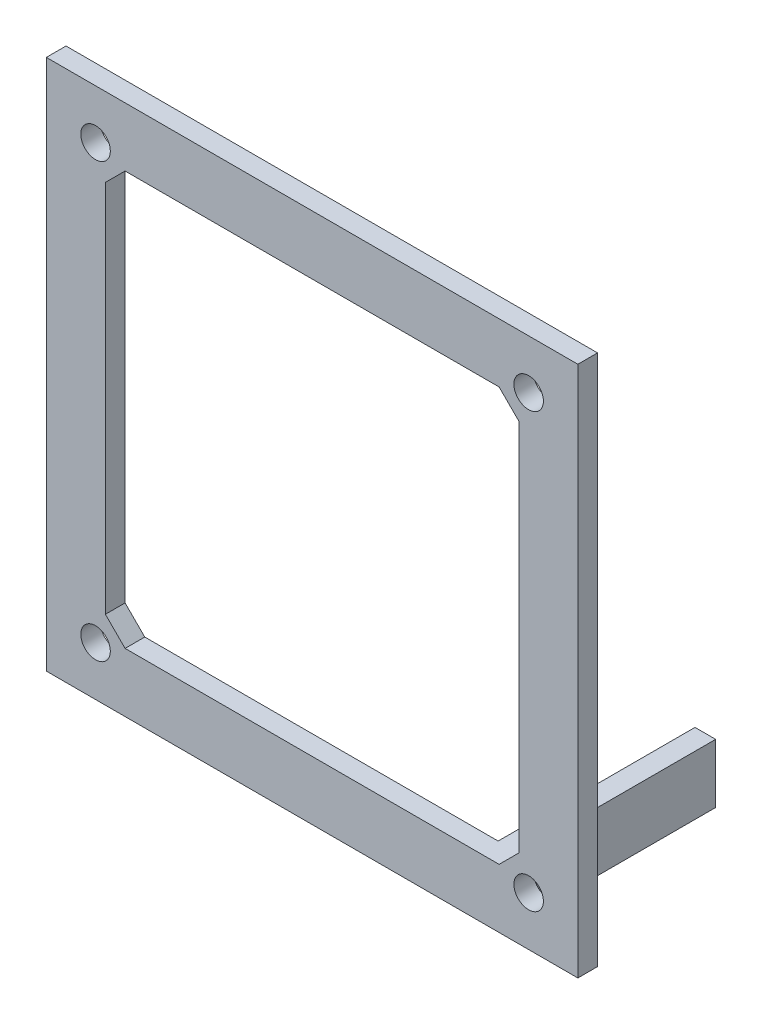
ISO-10303-21;
HEADER;
FILE_DESCRIPTION(('STEP AP214'),'2;1');
FILE_NAME('part.step','',(''),(''),'','','');
FILE_SCHEMA(('AUTOMOTIVE_DESIGN { 1 0 10303 214 1 1 1 1 }'));
ENDSEC;
DATA;
#1=APPLICATION_CONTEXT('core data for automotive mechanical design processes');
#2=APPLICATION_PROTOCOL_DEFINITION('international standard','automotive_design',2000,#1);
#3=PRODUCT_CONTEXT('',#1,'mechanical');
#4=PRODUCT('Part','Part','',(#3));
#5=PRODUCT_RELATED_PRODUCT_CATEGORY('part','',(#4));
#6=PRODUCT_DEFINITION_FORMATION('','',#4);
#7=PRODUCT_DEFINITION_CONTEXT('part definition',#1,'design');
#8=PRODUCT_DEFINITION('design','',#6,#7);
#9=PRODUCT_DEFINITION_SHAPE('','',#8);
#10=(LENGTH_UNIT() NAMED_UNIT(*) SI_UNIT(.MILLI.,.METRE.));
#11=(NAMED_UNIT(*) PLANE_ANGLE_UNIT() SI_UNIT($,.RADIAN.));
#12=(NAMED_UNIT(*) SI_UNIT($,.STERADIAN.) SOLID_ANGLE_UNIT());
#13=UNCERTAINTY_MEASURE_WITH_UNIT(LENGTH_MEASURE(1.E-05),#10,'distance_accuracy_value','');
#14=(GEOMETRIC_REPRESENTATION_CONTEXT(3) GLOBAL_UNCERTAINTY_ASSIGNED_CONTEXT((#13)) GLOBAL_UNIT_ASSIGNED_CONTEXT((#10,
#11,#12)) REPRESENTATION_CONTEXT('',''));
#15=CARTESIAN_POINT('',(0.,0.,0.));
#16=DIRECTION('',(0.,0.,1.));
#17=DIRECTION('',(1.,0.,0.));
#18=AXIS2_PLACEMENT_3D('',#15,#16,#17);
#19=CARTESIAN_POINT('',(0.,0.,0.));
#20=DIRECTION('',(0.,0.,1.));
#21=DIRECTION('',(1.,0.,0.));
#22=AXIS2_PLACEMENT_3D('',#19,#20,#21);
#23=PLANE('',#22);
#24=CARTESIAN_POINT('',(-70.7747798287289,-23.2326109767206,0.));
#25=DIRECTION('',(0.,0.,1.));
#26=DIRECTION('',(1.,0.,0.));
#27=AXIS2_PLACEMENT_3D('',#24,#25,#26);
#28=CIRCLE('',#27,1.5);
#29=CARTESIAN_POINT('',(-69.2747798287289,-23.2326109767206,0.));
#30=VERTEX_POINT('',#29);
#31=EDGE_CURVE('E279',#30,#30,#28,.T.);
#32=ORIENTED_EDGE('',*,*,#31,.T.);
#33=EDGE_LOOP('',(#32));
#34=FACE_BOUND('',#33,.T.);
#35=CARTESIAN_POINT('',(-26.7747798287289,-23.2326109767206,0.));
#36=DIRECTION('',(0.,0.,1.));
#37=DIRECTION('',(1.,0.,0.));
#38=AXIS2_PLACEMENT_3D('',#35,#36,#37);
#39=CIRCLE('',#38,1.5);
#40=CARTESIAN_POINT('',(-25.2747798287289,-23.2326109767206,0.));
#41=VERTEX_POINT('',#40);
#42=EDGE_CURVE('E283',#41,#41,#39,.T.);
#43=ORIENTED_EDGE('',*,*,#42,.T.);
#44=EDGE_LOOP('',(#43));
#45=FACE_BOUND('',#44,.T.);
#46=CARTESIAN_POINT('',(-26.7747798287294,20.7673890232794,0.));
#47=DIRECTION('',(0.,0.,1.));
#48=DIRECTION('',(1.,0.,0.));
#49=AXIS2_PLACEMENT_3D('',#46,#47,#48);
#50=CIRCLE('',#49,1.5);
#51=CARTESIAN_POINT('',(-25.2747798287294,20.7673890232794,0.));
#52=VERTEX_POINT('',#51);
#53=EDGE_CURVE('E286',#52,#52,#50,.T.);
#54=ORIENTED_EDGE('',*,*,#53,.T.);
#55=EDGE_LOOP('',(#54));
#56=FACE_BOUND('',#55,.T.);
#57=CARTESIAN_POINT('',(-70.7747798287294,20.7673890232794,0.));
#58=DIRECTION('',(0.,0.,1.));
#59=DIRECTION('',(1.,0.,0.));
#60=AXIS2_PLACEMENT_3D('',#57,#58,#59);
#61=CIRCLE('',#60,1.5);
#62=CARTESIAN_POINT('',(-69.2747798287294,20.7673890232794,0.));
#63=VERTEX_POINT('',#62);
#64=EDGE_CURVE('E42',#63,#63,#61,.T.);
#65=ORIENTED_EDGE('',*,*,#64,.T.);
#66=EDGE_LOOP('',(#65));
#67=FACE_BOUND('',#66,.T.);
#68=DIRECTION('',(0.,-1.,0.));
#69=VECTOR('',#68,1.);
#70=CARTESIAN_POINT('',(-29.7747798287294,-22.2326109767206,0.));
#71=LINE('',#70,#69);
#72=CARTESIAN_POINT('',(-29.7747798287294,-22.2326109767207,0.));
#73=VERTEX_POINT('',#72);
#74=CARTESIAN_POINT('',(-29.7747798287294,-28.2326109767206,0.));
#75=VERTEX_POINT('',#74);
#76=EDGE_CURVE('E36',#73,#75,#71,.T.);
#77=ORIENTED_EDGE('',*,*,#76,.F.);
#78=DIRECTION('',(0.707106781186547,0.707106781186548,0.));
#79=VECTOR('',#78,1.);
#80=CARTESIAN_POINT('',(-27.7747798287294,-20.2326109767207,0.));
#81=LINE('',#80,#79);
#82=CARTESIAN_POINT('',(-27.7747798287294,-20.2326109767207,0.));
#83=VERTEX_POINT('',#82);
#84=EDGE_CURVE('E212',#73,#83,#81,.T.);
#85=ORIENTED_EDGE('',*,*,#84,.T.);
#86=DIRECTION('',(0.,1.,0.));
#87=VECTOR('',#86,1.);
#88=CARTESIAN_POINT('',(-27.7747798287294,17.7673890232793,0.));
#89=LINE('',#88,#87);
#90=CARTESIAN_POINT('',(-27.7747798287294,17.7673890232793,0.));
#91=VERTEX_POINT('',#90);
#92=EDGE_CURVE('E220',#83,#91,#89,.T.);
#93=ORIENTED_EDGE('',*,*,#92,.T.);
#94=DIRECTION('',(-0.707106781186552,0.707106781186543,0.));
#95=VECTOR('',#94,1.);
#96=CARTESIAN_POINT('',(-29.7747798287294,19.7673890232793,0.));
#97=LINE('',#96,#95);
#98=CARTESIAN_POINT('',(-29.7747798287294,19.7673890232793,0.));
#99=VERTEX_POINT('',#98);
#100=EDGE_CURVE('E223',#91,#99,#97,.T.);
#101=ORIENTED_EDGE('',*,*,#100,.T.);
#102=DIRECTION('',(-1.,0.,0.));
#103=VECTOR('',#102,1.);
#104=CARTESIAN_POINT('',(-67.7747798287295,19.7673890232794,0.));
#105=LINE('',#104,#103);
#106=CARTESIAN_POINT('',(-67.7747798287295,19.7673890232794,0.));
#107=VERTEX_POINT('',#106);
#108=EDGE_CURVE('E226',#99,#107,#105,.T.);
#109=ORIENTED_EDGE('',*,*,#108,.T.);
#110=DIRECTION('',(-0.707106781186533,-0.707106781186562,0.));
#111=VECTOR('',#110,1.);
#112=CARTESIAN_POINT('',(-69.7747798287294,17.7673890232794,0.));
#113=LINE('',#112,#111);
#114=CARTESIAN_POINT('',(-69.7747798287294,17.7673890232794,0.));
#115=VERTEX_POINT('',#114);
#116=EDGE_CURVE('E229',#107,#115,#113,.T.);
#117=ORIENTED_EDGE('',*,*,#116,.T.);
#118=DIRECTION('',(0.,-1.,0.));
#119=VECTOR('',#118,1.);
#120=CARTESIAN_POINT('',(-69.7747798287294,-20.2326109767207,0.));
#121=LINE('',#120,#119);
#122=CARTESIAN_POINT('',(-69.7747798287294,-20.2326109767207,0.));
#123=VERTEX_POINT('',#122);
#124=EDGE_CURVE('E292',#115,#123,#121,.T.);
#125=ORIENTED_EDGE('',*,*,#124,.T.);
#126=DIRECTION('',(0.707106781186549,-0.707106781186546,0.));
#127=VECTOR('',#126,1.);
#128=CARTESIAN_POINT('',(-67.7747798287295,-22.2326109767206,0.));
#129=LINE('',#128,#127);
#130=CARTESIAN_POINT('',(-67.7747798287295,-22.2326109767206,0.));
#131=VERTEX_POINT('',#130);
#132=EDGE_CURVE('E213',#123,#131,#129,.T.);
#133=ORIENTED_EDGE('',*,*,#132,.T.);
#134=DIRECTION('',(1.,0.,0.));
#135=VECTOR('',#134,1.);
#136=CARTESIAN_POINT('',(-29.7747798287294,-22.2326109767207,0.));
#137=LINE('',#136,#135);
#138=CARTESIAN_POINT('',(-31.8747798287294,-22.2326109767206,0.));
#139=VERTEX_POINT('',#138);
#140=EDGE_CURVE('E209',#131,#139,#137,.T.);
#141=ORIENTED_EDGE('',*,*,#140,.T.);
#142=DIRECTION('',(0.,1.,0.));
#143=VECTOR('',#142,1.);
#144=CARTESIAN_POINT('',(-31.8747798287294,-22.2326109767206,0.));
#145=LINE('',#144,#143);
#146=CARTESIAN_POINT('',(-31.8747798287294,-28.2326109767206,0.));
#147=VERTEX_POINT('',#146);
#148=EDGE_CURVE('E50',#147,#139,#145,.T.);
#149=ORIENTED_EDGE('',*,*,#148,.F.);
#150=DIRECTION('',(-1.,0.,0.));
#151=VECTOR('',#150,1.);
#152=CARTESIAN_POINT('',(-21.7747798287294,-28.2326109767206,0.));
#153=LINE('',#152,#151);
#154=CARTESIAN_POINT('',(-75.7747798287294,-28.2326109767206,0.));
#155=VERTEX_POINT('',#154);
#156=EDGE_CURVE('E168',#147,#155,#153,.T.);
#157=ORIENTED_EDGE('',*,*,#156,.T.);
#158=DIRECTION('',(0.,1.,0.));
#159=VECTOR('',#158,1.);
#160=CARTESIAN_POINT('',(-75.7747798287294,25.7673890232794,0.));
#161=LINE('',#160,#159);
#162=CARTESIAN_POINT('',(-75.7747798287294,25.7673890232794,0.));
#163=VERTEX_POINT('',#162);
#164=EDGE_CURVE('E205',#155,#163,#161,.T.);
#165=ORIENTED_EDGE('',*,*,#164,.T.);
#166=DIRECTION('',(1.,0.,0.));
#167=VECTOR('',#166,1.);
#168=CARTESIAN_POINT('',(-21.7747798287294,25.7673890232794,0.));
#169=LINE('',#168,#167);
#170=CARTESIAN_POINT('',(-21.7747798287294,25.7673890232794,0.));
#171=VERTEX_POINT('',#170);
#172=EDGE_CURVE('E194',#163,#171,#169,.T.);
#173=ORIENTED_EDGE('',*,*,#172,.T.);
#174=DIRECTION('',(0.,-1.,0.));
#175=VECTOR('',#174,1.);
#176=CARTESIAN_POINT('',(-21.7747798287294,25.7673890232794,0.));
#177=LINE('',#176,#175);
#178=CARTESIAN_POINT('',(-21.7747798287294,-28.2326109767206,0.));
#179=VERTEX_POINT('',#178);
#180=EDGE_CURVE('E166',#171,#179,#177,.T.);
#181=ORIENTED_EDGE('',*,*,#180,.T.);
#182=EDGE_CURVE('E57',#179,#75,#153,.T.);
#183=ORIENTED_EDGE('',*,*,#182,.T.);
#184=EDGE_LOOP('',(#77,#85,#93,#101,#109,#117,#125,#133,#141,#149,#157,#165,#173,#181,#183));
#185=FACE_BOUND('',#184,.T.);
#186=ADVANCED_FACE('F33',(#34,#45,#56,#67,#185),#23,.F.);
#187=CARTESIAN_POINT('',(0.,0.,2.));
#188=DIRECTION('',(0.,0.,1.));
#189=DIRECTION('',(1.,0.,0.));
#190=AXIS2_PLACEMENT_3D('',#187,#188,#189);
#191=PLANE('',#190);
#192=CARTESIAN_POINT('',(-26.7747798287289,-23.2326109767206,2.));
#193=DIRECTION('',(0.,0.,1.));
#194=DIRECTION('',(1.,0.,0.));
#195=AXIS2_PLACEMENT_3D('',#192,#193,#194);
#196=CIRCLE('',#195,1.5);
#197=CARTESIAN_POINT('',(-25.2747798287289,-23.2326109767206,2.));
#198=VERTEX_POINT('',#197);
#199=EDGE_CURVE('E289',#198,#198,#196,.T.);
#200=ORIENTED_EDGE('',*,*,#199,.F.);
#201=EDGE_LOOP('',(#200));
#202=FACE_BOUND('',#201,.T.);
#203=DIRECTION('',(0.707106781186549,-0.707106781186546,0.));
#204=VECTOR('',#203,1.);
#205=CARTESIAN_POINT('',(-67.7747798287295,-22.2326109767206,2.));
#206=LINE('',#205,#204);
#207=CARTESIAN_POINT('',(-69.7747798287294,-20.2326109767207,2.));
#208=VERTEX_POINT('',#207);
#209=CARTESIAN_POINT('',(-67.7747798287295,-22.2326109767206,2.));
#210=VERTEX_POINT('',#209);
#211=EDGE_CURVE('E299',#208,#210,#206,.T.);
#212=ORIENTED_EDGE('',*,*,#211,.F.);
#213=DIRECTION('',(0.,-1.,0.));
#214=VECTOR('',#213,1.);
#215=CARTESIAN_POINT('',(-69.7747798287294,-20.2326109767207,2.));
#216=LINE('',#215,#214);
#217=CARTESIAN_POINT('',(-69.7747798287294,17.7673890232794,2.));
#218=VERTEX_POINT('',#217);
#219=EDGE_CURVE('E232',#218,#208,#216,.T.);
#220=ORIENTED_EDGE('',*,*,#219,.F.);
#221=DIRECTION('',(-0.707106781186533,-0.707106781186562,0.));
#222=VECTOR('',#221,1.);
#223=CARTESIAN_POINT('',(-69.7747798287294,17.7673890232794,2.));
#224=LINE('',#223,#222);
#225=CARTESIAN_POINT('',(-67.7747798287295,19.7673890232794,2.));
#226=VERTEX_POINT('',#225);
#227=EDGE_CURVE('E237',#226,#218,#224,.T.);
#228=ORIENTED_EDGE('',*,*,#227,.F.);
#229=DIRECTION('',(-1.,0.,0.));
#230=VECTOR('',#229,1.);
#231=CARTESIAN_POINT('',(-67.7747798287295,19.7673890232794,2.));
#232=LINE('',#231,#230);
#233=CARTESIAN_POINT('',(-29.7747798287294,19.7673890232793,2.));
#234=VERTEX_POINT('',#233);
#235=EDGE_CURVE('E309',#234,#226,#232,.T.);
#236=ORIENTED_EDGE('',*,*,#235,.F.);
#237=DIRECTION('',(-0.707106781186552,0.707106781186543,0.));
#238=VECTOR('',#237,1.);
#239=CARTESIAN_POINT('',(-29.7747798287294,19.7673890232793,2.));
#240=LINE('',#239,#238);
#241=CARTESIAN_POINT('',(-27.7747798287294,17.7673890232793,2.));
#242=VERTEX_POINT('',#241);
#243=EDGE_CURVE('E307',#242,#234,#240,.T.);
#244=ORIENTED_EDGE('',*,*,#243,.F.);
#245=DIRECTION('',(0.,1.,0.));
#246=VECTOR('',#245,1.);
#247=CARTESIAN_POINT('',(-27.7747798287294,17.7673890232793,2.));
#248=LINE('',#247,#246);
#249=CARTESIAN_POINT('',(-27.7747798287294,-20.2326109767207,2.));
#250=VERTEX_POINT('',#249);
#251=EDGE_CURVE('E305',#250,#242,#248,.T.);
#252=ORIENTED_EDGE('',*,*,#251,.F.);
#253=DIRECTION('',(0.707106781186547,0.707106781186548,0.));
#254=VECTOR('',#253,1.);
#255=CARTESIAN_POINT('',(-27.7747798287294,-20.2326109767207,2.));
#256=LINE('',#255,#254);
#257=CARTESIAN_POINT('',(-29.7747798287294,-22.2326109767207,2.));
#258=VERTEX_POINT('',#257);
#259=EDGE_CURVE('E303',#258,#250,#256,.T.);
#260=ORIENTED_EDGE('',*,*,#259,.F.);
#261=DIRECTION('',(1.,0.,0.));
#262=VECTOR('',#261,1.);
#263=CARTESIAN_POINT('',(-29.7747798287294,-22.2326109767207,2.));
#264=LINE('',#263,#262);
#265=EDGE_CURVE('E301',#210,#258,#264,.T.);
#266=ORIENTED_EDGE('',*,*,#265,.F.);
#267=EDGE_LOOP('',(#212,#220,#228,#236,#244,#252,#260,#266));
#268=FACE_BOUND('',#267,.T.);
#269=CARTESIAN_POINT('',(-70.7747798287294,20.7673890232794,2.));
#270=DIRECTION('',(0.,0.,1.));
#271=DIRECTION('',(1.,0.,0.));
#272=AXIS2_PLACEMENT_3D('',#269,#270,#271);
#273=CIRCLE('',#272,1.5);
#274=CARTESIAN_POINT('',(-69.2747798287294,20.7673890232794,2.));
#275=VERTEX_POINT('',#274);
#276=EDGE_CURVE('E11',#275,#275,#273,.T.);
#277=ORIENTED_EDGE('',*,*,#276,.F.);
#278=EDGE_LOOP('',(#277));
#279=FACE_BOUND('',#278,.T.);
#280=CARTESIAN_POINT('',(-26.7747798287294,20.7673890232794,2.));
#281=DIRECTION('',(0.,0.,1.));
#282=DIRECTION('',(1.,0.,0.));
#283=AXIS2_PLACEMENT_3D('',#280,#281,#282);
#284=CIRCLE('',#283,1.5);
#285=CARTESIAN_POINT('',(-25.2747798287294,20.7673890232794,2.));
#286=VERTEX_POINT('',#285);
#287=EDGE_CURVE('E288',#286,#286,#284,.T.);
#288=ORIENTED_EDGE('',*,*,#287,.F.);
#289=EDGE_LOOP('',(#288));
#290=FACE_BOUND('',#289,.T.);
#291=CARTESIAN_POINT('',(-70.7747798287289,-23.2326109767206,2.));
#292=DIRECTION('',(0.,0.,1.));
#293=DIRECTION('',(1.,0.,0.));
#294=AXIS2_PLACEMENT_3D('',#291,#292,#293);
#295=CIRCLE('',#294,1.5);
#296=CARTESIAN_POINT('',(-69.2747798287289,-23.2326109767206,2.));
#297=VERTEX_POINT('',#296);
#298=EDGE_CURVE('E539',#297,#297,#295,.T.);
#299=ORIENTED_EDGE('',*,*,#298,.F.);
#300=EDGE_LOOP('',(#299));
#301=FACE_BOUND('',#300,.T.);
#302=DIRECTION('',(0.,-1.,0.));
#303=VECTOR('',#302,1.);
#304=CARTESIAN_POINT('',(-21.7747798287294,25.7673890232794,2.));
#305=LINE('',#304,#303);
#306=CARTESIAN_POINT('',(-21.7747798287294,25.7673890232794,2.));
#307=VERTEX_POINT('',#306);
#308=CARTESIAN_POINT('',(-21.7747798287294,-28.2326109767206,2.));
#309=VERTEX_POINT('',#308);
#310=EDGE_CURVE('E190',#307,#309,#305,.T.);
#311=ORIENTED_EDGE('',*,*,#310,.F.);
#312=DIRECTION('',(1.,0.,0.));
#313=VECTOR('',#312,1.);
#314=CARTESIAN_POINT('',(-21.7747798287294,25.7673890232794,2.));
#315=LINE('',#314,#313);
#316=CARTESIAN_POINT('',(-75.7747798287294,25.7673890232794,2.));
#317=VERTEX_POINT('',#316);
#318=EDGE_CURVE('E200',#317,#307,#315,.T.);
#319=ORIENTED_EDGE('',*,*,#318,.F.);
#320=DIRECTION('',(0.,1.,0.));
#321=VECTOR('',#320,1.);
#322=CARTESIAN_POINT('',(-75.7747798287294,25.7673890232794,2.));
#323=LINE('',#322,#321);
#324=CARTESIAN_POINT('',(-75.7747798287294,-28.2326109767206,2.));
#325=VERTEX_POINT('',#324);
#326=EDGE_CURVE('E197',#325,#317,#323,.T.);
#327=ORIENTED_EDGE('',*,*,#326,.F.);
#328=DIRECTION('',(-1.,0.,0.));
#329=VECTOR('',#328,1.);
#330=CARTESIAN_POINT('',(-21.7747798287294,-28.2326109767206,2.));
#331=LINE('',#330,#329);
#332=EDGE_CURVE('E193',#309,#325,#331,.T.);
#333=ORIENTED_EDGE('',*,*,#332,.F.);
#334=EDGE_LOOP('',(#311,#319,#327,#333));
#335=FACE_BOUND('',#334,.T.);
#336=ADVANCED_FACE('F262',(#202,#268,#279,#290,#301,#335),#191,.T.);
#337=CARTESIAN_POINT('',(-70.7747798287294,20.7673890232794,2.));
#338=DIRECTION('',(0.,0.,-1.));
#339=DIRECTION('',(-1.,0.,0.));
#340=AXIS2_PLACEMENT_3D('',#337,#338,#339);
#341=CYLINDRICAL_SURFACE('',#340,1.5);
#342=ORIENTED_EDGE('',*,*,#276,.T.);
#343=EDGE_LOOP('',(#342));
#344=FACE_BOUND('',#343,.T.);
#345=ORIENTED_EDGE('',*,*,#64,.F.);
#346=EDGE_LOOP('',(#345));
#347=FACE_BOUND('',#346,.T.);
#348=ADVANCED_FACE('F259',(#344,#347),#341,.F.);
#349=CARTESIAN_POINT('',(-69.7747798287294,-20.2326109767207,2.));
#350=DIRECTION('',(1.,0.,0.));
#351=DIRECTION('',(0.,0.,-1.));
#352=AXIS2_PLACEMENT_3D('',#349,#350,#351);
#353=PLANE('',#352);
#354=ORIENTED_EDGE('',*,*,#124,.F.);
#355=DIRECTION('',(0.,0.,-1.));
#356=VECTOR('',#355,1.);
#357=CARTESIAN_POINT('',(-69.7747798287294,17.7673890232794,2.));
#358=LINE('',#357,#356);
#359=EDGE_CURVE('E233',#218,#115,#358,.T.);
#360=ORIENTED_EDGE('',*,*,#359,.F.);
#361=ORIENTED_EDGE('',*,*,#219,.T.);
#362=DIRECTION('',(0.,0.,-1.));
#363=VECTOR('',#362,1.);
#364=CARTESIAN_POINT('',(-69.7747798287294,-20.2326109767207,2.));
#365=LINE('',#364,#363);
#366=EDGE_CURVE('E250',#208,#123,#365,.T.);
#367=ORIENTED_EDGE('',*,*,#366,.T.);
#368=EDGE_LOOP('',(#354,#360,#361,#367));
#369=FACE_BOUND('',#368,.T.);
#370=ADVANCED_FACE('F261',(#369),#353,.T.);
#371=CARTESIAN_POINT('',(-67.7747798287295,-22.2326109767206,2.));
#372=DIRECTION('',(0.707106781186546,0.707106781186549,0.));
#373=DIRECTION('',(-0.707106781186549,0.707106781186546,0.));
#374=AXIS2_PLACEMENT_3D('',#371,#372,#373);
#375=PLANE('',#374);
#376=ORIENTED_EDGE('',*,*,#132,.F.);
#377=ORIENTED_EDGE('',*,*,#366,.F.);
#378=ORIENTED_EDGE('',*,*,#211,.T.);
#379=DIRECTION('',(0.,0.,-1.));
#380=VECTOR('',#379,1.);
#381=CARTESIAN_POINT('',(-67.7747798287295,-22.2326109767206,2.));
#382=LINE('',#381,#380);
#383=EDGE_CURVE('E248',#210,#131,#382,.T.);
#384=ORIENTED_EDGE('',*,*,#383,.T.);
#385=EDGE_LOOP('',(#376,#377,#378,#384));
#386=FACE_BOUND('',#385,.T.);
#387=ADVANCED_FACE('F269',(#386),#375,.T.);
#388=CARTESIAN_POINT('',(-29.7747798287294,-22.2326109767207,2.));
#389=DIRECTION('',(0.,1.,0.));
#390=DIRECTION('',(-1.,0.,0.));
#391=AXIS2_PLACEMENT_3D('',#388,#389,#390);
#392=PLANE('',#391);
#393=ORIENTED_EDGE('',*,*,#140,.F.);
#394=ORIENTED_EDGE('',*,*,#383,.F.);
#395=ORIENTED_EDGE('',*,*,#265,.T.);
#396=DIRECTION('',(0.,0.,-1.));
#397=VECTOR('',#396,1.);
#398=CARTESIAN_POINT('',(-29.7747798287294,-22.2326109767207,2.));
#399=LINE('',#398,#397);
#400=EDGE_CURVE('E245',#258,#73,#399,.T.);
#401=ORIENTED_EDGE('',*,*,#400,.T.);
#402=DIRECTION('',(0.,0.,1.));
#403=VECTOR('',#402,1.);
#404=CARTESIAN_POINT('',(-29.7747798287294,-22.2326109767206,-20.));
#405=LINE('',#404,#403);
#406=CARTESIAN_POINT('',(-29.7747798287294,-22.2326109767206,-20.));
#407=VERTEX_POINT('',#406);
#408=EDGE_CURVE('E180',#407,#73,#405,.T.);
#409=ORIENTED_EDGE('',*,*,#408,.F.);
#410=DIRECTION('',(1.,0.,0.));
#411=VECTOR('',#410,1.);
#412=CARTESIAN_POINT('',(-29.7747798287294,-22.2326109767206,-20.));
#413=LINE('',#412,#411);
#414=CARTESIAN_POINT('',(-31.8747798287294,-22.2326109767206,-20.));
#415=VERTEX_POINT('',#414);
#416=EDGE_CURVE('E160',#415,#407,#413,.T.);
#417=ORIENTED_EDGE('',*,*,#416,.F.);
#418=DIRECTION('',(0.,0.,1.));
#419=VECTOR('',#418,1.);
#420=CARTESIAN_POINT('',(-31.8747798287294,-22.2326109767206,-20.));
#421=LINE('',#420,#419);
#422=EDGE_CURVE('E170',#415,#139,#421,.T.);
#423=ORIENTED_EDGE('',*,*,#422,.T.);
#424=EDGE_LOOP('',(#393,#394,#395,#401,#409,#417,#423));
#425=FACE_BOUND('',#424,.T.);
#426=ADVANCED_FACE('F319',(#425),#392,.T.);
#427=CARTESIAN_POINT('',(-27.7747798287294,-20.2326109767207,2.));
#428=DIRECTION('',(-0.707106781186548,0.707106781186547,0.));
#429=DIRECTION('',(-0.707106781186547,-0.707106781186548,0.));
#430=AXIS2_PLACEMENT_3D('',#427,#428,#429);
#431=PLANE('',#430);
#432=ORIENTED_EDGE('',*,*,#84,.F.);
#433=ORIENTED_EDGE('',*,*,#400,.F.);
#434=ORIENTED_EDGE('',*,*,#259,.T.);
#435=DIRECTION('',(0.,0.,-1.));
#436=VECTOR('',#435,1.);
#437=CARTESIAN_POINT('',(-27.7747798287294,-20.2326109767207,2.));
#438=LINE('',#437,#436);
#439=EDGE_CURVE('E243',#250,#83,#438,.T.);
#440=ORIENTED_EDGE('',*,*,#439,.T.);
#441=EDGE_LOOP('',(#432,#433,#434,#440));
#442=FACE_BOUND('',#441,.T.);
#443=ADVANCED_FACE('F374',(#442),#431,.T.);
#444=CARTESIAN_POINT('',(-27.7747798287294,17.7673890232793,2.));
#445=DIRECTION('',(-1.,0.,0.));
#446=DIRECTION('',(0.,-1.,0.));
#447=AXIS2_PLACEMENT_3D('',#444,#445,#446);
#448=PLANE('',#447);
#449=ORIENTED_EDGE('',*,*,#92,.F.);
#450=ORIENTED_EDGE('',*,*,#439,.F.);
#451=ORIENTED_EDGE('',*,*,#251,.T.);
#452=DIRECTION('',(0.,0.,-1.));
#453=VECTOR('',#452,1.);
#454=CARTESIAN_POINT('',(-27.7747798287294,17.7673890232793,2.));
#455=LINE('',#454,#453);
#456=EDGE_CURVE('E241',#242,#91,#455,.T.);
#457=ORIENTED_EDGE('',*,*,#456,.T.);
#458=EDGE_LOOP('',(#449,#450,#451,#457));
#459=FACE_BOUND('',#458,.T.);
#460=ADVANCED_FACE('F370',(#459),#448,.T.);
#461=CARTESIAN_POINT('',(-29.7747798287294,19.7673890232793,2.));
#462=DIRECTION('',(-0.707106781186543,-0.707106781186552,0.));
#463=DIRECTION('',(0.707106781186552,-0.707106781186543,0.));
#464=AXIS2_PLACEMENT_3D('',#461,#462,#463);
#465=PLANE('',#464);
#466=ORIENTED_EDGE('',*,*,#100,.F.);
#467=ORIENTED_EDGE('',*,*,#456,.F.);
#468=ORIENTED_EDGE('',*,*,#243,.T.);
#469=DIRECTION('',(0.,0.,-1.));
#470=VECTOR('',#469,1.);
#471=CARTESIAN_POINT('',(-29.7747798287294,19.7673890232793,2.));
#472=LINE('',#471,#470);
#473=EDGE_CURVE('E239',#234,#99,#472,.T.);
#474=ORIENTED_EDGE('',*,*,#473,.T.);
#475=EDGE_LOOP('',(#466,#467,#468,#474));
#476=FACE_BOUND('',#475,.T.);
#477=ADVANCED_FACE('F366',(#476),#465,.T.);
#478=CARTESIAN_POINT('',(-67.7747798287295,19.7673890232794,2.));
#479=DIRECTION('',(0.,-1.,0.));
#480=DIRECTION('',(1.,0.,0.));
#481=AXIS2_PLACEMENT_3D('',#478,#479,#480);
#482=PLANE('',#481);
#483=ORIENTED_EDGE('',*,*,#108,.F.);
#484=ORIENTED_EDGE('',*,*,#473,.F.);
#485=ORIENTED_EDGE('',*,*,#235,.T.);
#486=DIRECTION('',(0.,0.,-1.));
#487=VECTOR('',#486,1.);
#488=CARTESIAN_POINT('',(-67.7747798287295,19.7673890232794,2.));
#489=LINE('',#488,#487);
#490=EDGE_CURVE('E236',#226,#107,#489,.T.);
#491=ORIENTED_EDGE('',*,*,#490,.T.);
#492=EDGE_LOOP('',(#483,#484,#485,#491));
#493=FACE_BOUND('',#492,.T.);
#494=ADVANCED_FACE('F362',(#493),#482,.T.);
#495=CARTESIAN_POINT('',(-69.7747798287294,17.7673890232794,2.));
#496=DIRECTION('',(0.707106781186562,-0.707106781186533,0.));
#497=DIRECTION('',(0.707106781186533,0.707106781186562,0.));
#498=AXIS2_PLACEMENT_3D('',#495,#496,#497);
#499=PLANE('',#498);
#500=ORIENTED_EDGE('',*,*,#116,.F.);
#501=ORIENTED_EDGE('',*,*,#490,.F.);
#502=ORIENTED_EDGE('',*,*,#227,.T.);
#503=ORIENTED_EDGE('',*,*,#359,.T.);
#504=EDGE_LOOP('',(#500,#501,#502,#503));
#505=FACE_BOUND('',#504,.T.);
#506=ADVANCED_FACE('F358',(#505),#499,.T.);
#507=CARTESIAN_POINT('',(-26.7747798287294,20.7673890232794,2.));
#508=DIRECTION('',(0.,0.,-1.));
#509=DIRECTION('',(-1.,0.,0.));
#510=AXIS2_PLACEMENT_3D('',#507,#508,#509);
#511=CYLINDRICAL_SURFACE('',#510,1.5);
#512=ORIENTED_EDGE('',*,*,#287,.T.);
#513=EDGE_LOOP('',(#512));
#514=FACE_BOUND('',#513,.T.);
#515=ORIENTED_EDGE('',*,*,#53,.F.);
#516=EDGE_LOOP('',(#515));
#517=FACE_BOUND('',#516,.T.);
#518=ADVANCED_FACE('F354',(#514,#517),#511,.F.);
#519=CARTESIAN_POINT('',(-26.7747798287289,-23.2326109767206,2.));
#520=DIRECTION('',(0.,0.,-1.));
#521=DIRECTION('',(-1.,0.,0.));
#522=AXIS2_PLACEMENT_3D('',#519,#520,#521);
#523=CYLINDRICAL_SURFACE('',#522,1.5);
#524=ORIENTED_EDGE('',*,*,#199,.T.);
#525=EDGE_LOOP('',(#524));
#526=FACE_BOUND('',#525,.T.);
#527=ORIENTED_EDGE('',*,*,#42,.F.);
#528=EDGE_LOOP('',(#527));
#529=FACE_BOUND('',#528,.T.);
#530=ADVANCED_FACE('F350',(#526,#529),#523,.F.);
#531=CARTESIAN_POINT('',(-70.7747798287289,-23.2326109767206,2.));
#532=DIRECTION('',(0.,0.,-1.));
#533=DIRECTION('',(-1.,0.,0.));
#534=AXIS2_PLACEMENT_3D('',#531,#532,#533);
#535=CYLINDRICAL_SURFACE('',#534,1.5);
#536=ORIENTED_EDGE('',*,*,#298,.T.);
#537=EDGE_LOOP('',(#536));
#538=FACE_BOUND('',#537,.T.);
#539=ORIENTED_EDGE('',*,*,#31,.F.);
#540=EDGE_LOOP('',(#539));
#541=FACE_BOUND('',#540,.T.);
#542=ADVANCED_FACE('F346',(#538,#541),#535,.F.);
#543=CARTESIAN_POINT('',(-21.7747798287294,25.7673890232794,2.));
#544=DIRECTION('',(1.,0.,0.));
#545=DIRECTION('',(0.,1.,0.));
#546=AXIS2_PLACEMENT_3D('',#543,#544,#545);
#547=PLANE('',#546);
#548=ORIENTED_EDGE('',*,*,#180,.F.);
#549=DIRECTION('',(0.,0.,-1.));
#550=VECTOR('',#549,1.);
#551=CARTESIAN_POINT('',(-21.7747798287294,25.7673890232794,2.));
#552=LINE('',#551,#550);
#553=EDGE_CURVE('E545',#307,#171,#552,.T.);
#554=ORIENTED_EDGE('',*,*,#553,.F.);
#555=ORIENTED_EDGE('',*,*,#310,.T.);
#556=DIRECTION('',(0.,0.,-1.));
#557=VECTOR('',#556,1.);
#558=CARTESIAN_POINT('',(-21.7747798287294,-28.2326109767206,2.));
#559=LINE('',#558,#557);
#560=EDGE_CURVE('E202',#309,#179,#559,.T.);
#561=ORIENTED_EDGE('',*,*,#560,.T.);
#562=EDGE_LOOP('',(#548,#554,#555,#561));
#563=FACE_BOUND('',#562,.T.);
#564=ADVANCED_FACE('F337',(#563),#547,.T.);
#565=CARTESIAN_POINT('',(-21.7747798287294,25.7673890232794,2.));
#566=DIRECTION('',(0.,1.,0.));
#567=DIRECTION('',(0.,0.,1.));
#568=AXIS2_PLACEMENT_3D('',#565,#566,#567);
#569=PLANE('',#568);
#570=ORIENTED_EDGE('',*,*,#172,.F.);
#571=DIRECTION('',(0.,0.,-1.));
#572=VECTOR('',#571,1.);
#573=CARTESIAN_POINT('',(-75.7747798287294,25.7673890232794,2.));
#574=LINE('',#573,#572);
#575=EDGE_CURVE('E547',#317,#163,#574,.T.);
#576=ORIENTED_EDGE('',*,*,#575,.F.);
#577=ORIENTED_EDGE('',*,*,#318,.T.);
#578=ORIENTED_EDGE('',*,*,#553,.T.);
#579=EDGE_LOOP('',(#570,#576,#577,#578));
#580=FACE_BOUND('',#579,.T.);
#581=ADVANCED_FACE('F333',(#580),#569,.T.);
#582=CARTESIAN_POINT('',(-75.7747798287294,25.7673890232794,2.));
#583=DIRECTION('',(-1.,0.,0.));
#584=DIRECTION('',(0.,0.,1.));
#585=AXIS2_PLACEMENT_3D('',#582,#583,#584);
#586=PLANE('',#585);
#587=ORIENTED_EDGE('',*,*,#164,.F.);
#588=DIRECTION('',(0.,0.,-1.));
#589=VECTOR('',#588,1.);
#590=CARTESIAN_POINT('',(-75.7747798287294,-28.2326109767206,2.));
#591=LINE('',#590,#589);
#592=EDGE_CURVE('E551',#325,#155,#591,.T.);
#593=ORIENTED_EDGE('',*,*,#592,.F.);
#594=ORIENTED_EDGE('',*,*,#326,.T.);
#595=ORIENTED_EDGE('',*,*,#575,.T.);
#596=EDGE_LOOP('',(#587,#593,#594,#595));
#597=FACE_BOUND('',#596,.T.);
#598=ADVANCED_FACE('F336',(#597),#586,.T.);
#599=CARTESIAN_POINT('',(-21.7747798287294,-28.2326109767206,2.));
#600=DIRECTION('',(0.,-1.,0.));
#601=DIRECTION('',(0.,0.,-1.));
#602=AXIS2_PLACEMENT_3D('',#599,#600,#601);
#603=PLANE('',#602);
#604=ORIENTED_EDGE('',*,*,#182,.F.);
#605=ORIENTED_EDGE('',*,*,#560,.F.);
#606=ORIENTED_EDGE('',*,*,#332,.T.);
#607=ORIENTED_EDGE('',*,*,#592,.T.);
#608=ORIENTED_EDGE('',*,*,#156,.F.);
#609=DIRECTION('',(0.,0.,1.));
#610=VECTOR('',#609,1.);
#611=CARTESIAN_POINT('',(-31.8747798287294,-28.2326109767206,-20.));
#612=LINE('',#611,#610);
#613=CARTESIAN_POINT('',(-31.8747798287294,-28.2326109767206,-20.));
#614=VERTEX_POINT('',#613);
#615=EDGE_CURVE('E151',#614,#147,#612,.T.);
#616=ORIENTED_EDGE('',*,*,#615,.F.);
#617=DIRECTION('',(-1.,0.,0.));
#618=VECTOR('',#617,1.);
#619=CARTESIAN_POINT('',(-29.7747798287294,-28.2326109767206,-20.));
#620=LINE('',#619,#618);
#621=CARTESIAN_POINT('',(-29.7747798287294,-28.2326109767206,-20.));
#622=VERTEX_POINT('',#621);
#623=EDGE_CURVE('E144',#622,#614,#620,.T.);
#624=ORIENTED_EDGE('',*,*,#623,.F.);
#625=DIRECTION('',(0.,0.,1.));
#626=VECTOR('',#625,1.);
#627=CARTESIAN_POINT('',(-29.7747798287294,-28.2326109767206,-20.));
#628=LINE('',#627,#626);
#629=EDGE_CURVE('E148',#622,#75,#628,.T.);
#630=ORIENTED_EDGE('',*,*,#629,.T.);
#631=EDGE_LOOP('',(#604,#605,#606,#607,#608,#616,#624,#630));
#632=FACE_BOUND('',#631,.T.);
#633=ADVANCED_FACE('F146',(#632),#603,.T.);
#634=CARTESIAN_POINT('',(-29.7747798287294,-22.2326109767206,-20.));
#635=DIRECTION('',(-1.,0.,0.));
#636=DIRECTION('',(0.,0.,1.));
#637=AXIS2_PLACEMENT_3D('',#634,#635,#636);
#638=PLANE('',#637);
#639=ORIENTED_EDGE('',*,*,#76,.T.);
#640=ORIENTED_EDGE('',*,*,#629,.F.);
#641=DIRECTION('',(0.,-1.,0.));
#642=VECTOR('',#641,1.);
#643=CARTESIAN_POINT('',(-29.7747798287294,-22.2326109767206,-20.));
#644=LINE('',#643,#642);
#645=EDGE_CURVE('E155',#407,#622,#644,.T.);
#646=ORIENTED_EDGE('',*,*,#645,.F.);
#647=ORIENTED_EDGE('',*,*,#408,.T.);
#648=EDGE_LOOP('',(#639,#640,#646,#647));
#649=FACE_BOUND('',#648,.T.);
#650=ADVANCED_FACE('F165',(#649),#638,.F.);
#651=CARTESIAN_POINT('',(-31.8747798287294,-22.2326109767206,-20.));
#652=DIRECTION('',(1.,0.,0.));
#653=DIRECTION('',(0.,0.,-1.));
#654=AXIS2_PLACEMENT_3D('',#651,#652,#653);
#655=PLANE('',#654);
#656=ORIENTED_EDGE('',*,*,#148,.T.);
#657=ORIENTED_EDGE('',*,*,#422,.F.);
#658=DIRECTION('',(0.,1.,0.));
#659=VECTOR('',#658,1.);
#660=CARTESIAN_POINT('',(-31.8747798287294,-22.2326109767206,-20.));
#661=LINE('',#660,#659);
#662=EDGE_CURVE('E154',#614,#415,#661,.T.);
#663=ORIENTED_EDGE('',*,*,#662,.F.);
#664=ORIENTED_EDGE('',*,*,#615,.T.);
#665=EDGE_LOOP('',(#656,#657,#663,#664));
#666=FACE_BOUND('',#665,.T.);
#667=ADVANCED_FACE('F322',(#666),#655,.F.);
#668=CARTESIAN_POINT('',(0.,0.,-20.));
#669=DIRECTION('',(0.,0.,-1.));
#670=DIRECTION('',(-1.,0.,0.));
#671=AXIS2_PLACEMENT_3D('',#668,#669,#670);
#672=PLANE('',#671);
#673=ORIENTED_EDGE('',*,*,#645,.T.);
#674=ORIENTED_EDGE('',*,*,#623,.T.);
#675=ORIENTED_EDGE('',*,*,#662,.T.);
#676=ORIENTED_EDGE('',*,*,#416,.T.);
#677=EDGE_LOOP('',(#673,#674,#675,#676));
#678=FACE_BOUND('',#677,.T.);
#679=ADVANCED_FACE('F158',(#678),#672,.T.);
#680=CLOSED_SHELL('',(#186,#336,#348,#370,#387,#426,#443,#460,#477,#494,#506,#518,#530,#542,
#564,#581,#598,#633,#650,#667,#679));
#681=MANIFOLD_SOLID_BREP('B2',#680);
#682=ADVANCED_BREP_SHAPE_REPRESENTATION('',(#18,#681),#14);
#683=SHAPE_DEFINITION_REPRESENTATION(#9,#682);
ENDSEC;
END-ISO-10303-21;
